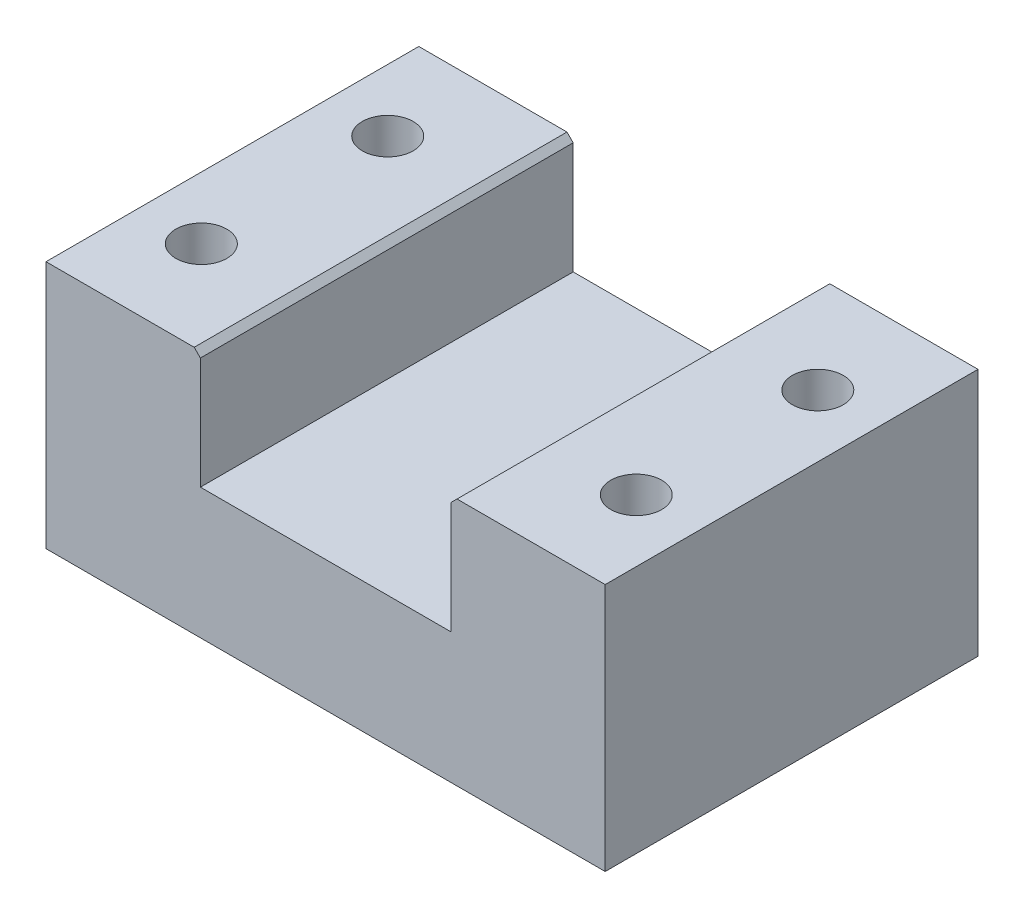
ISO-10303-21;
HEADER;
FILE_DESCRIPTION(('STEP AP214'),'2;1');
FILE_NAME('part.step','',(''),(''),'','','');
FILE_SCHEMA(('AUTOMOTIVE_DESIGN { 1 0 10303 214 1 1 1 1 }'));
ENDSEC;
DATA;
#1=APPLICATION_CONTEXT('core data for automotive mechanical design processes');
#2=APPLICATION_PROTOCOL_DEFINITION('international standard','automotive_design',2000,#1);
#3=PRODUCT_CONTEXT('',#1,'mechanical');
#4=PRODUCT('Part','Part','',(#3));
#5=PRODUCT_RELATED_PRODUCT_CATEGORY('part','',(#4));
#6=PRODUCT_DEFINITION_FORMATION('','',#4);
#7=PRODUCT_DEFINITION_CONTEXT('part definition',#1,'design');
#8=PRODUCT_DEFINITION('design','',#6,#7);
#9=PRODUCT_DEFINITION_SHAPE('','',#8);
#10=(LENGTH_UNIT() NAMED_UNIT(*) SI_UNIT(.MILLI.,.METRE.));
#11=(NAMED_UNIT(*) PLANE_ANGLE_UNIT() SI_UNIT($,.RADIAN.));
#12=(NAMED_UNIT(*) SI_UNIT($,.STERADIAN.) SOLID_ANGLE_UNIT());
#13=UNCERTAINTY_MEASURE_WITH_UNIT(LENGTH_MEASURE(1.E-05),#10,'distance_accuracy_value','');
#14=(GEOMETRIC_REPRESENTATION_CONTEXT(3) GLOBAL_UNCERTAINTY_ASSIGNED_CONTEXT((#13)) GLOBAL_UNIT_ASSIGNED_CONTEXT((#10,
#11,#12)) REPRESENTATION_CONTEXT('',''));
#15=CARTESIAN_POINT('',(0.,0.,0.));
#16=DIRECTION('',(0.,0.,1.));
#17=DIRECTION('',(1.,0.,0.));
#18=AXIS2_PLACEMENT_3D('',#15,#16,#17);
#19=CARTESIAN_POINT('',(0.,40.,0.));
#20=DIRECTION('',(0.,1.,0.));
#21=DIRECTION('',(0.,0.,1.));
#22=AXIS2_PLACEMENT_3D('',#19,#20,#21);
#23=PLANE('',#22);
#24=CARTESIAN_POINT('',(-35.,40.,-15.));
#25=DIRECTION('',(0.,-1.,0.));
#26=DIRECTION('',(0.,0.,-1.));
#27=AXIS2_PLACEMENT_3D('',#24,#25,#26);
#28=CIRCLE('',#27,4.1);
#29=CARTESIAN_POINT('',(-35.,40.,-19.1));
#30=VERTEX_POINT('',#29);
#31=EDGE_CURVE('E257',#30,#30,#28,.T.);
#32=ORIENTED_EDGE('',*,*,#31,.T.);
#33=EDGE_LOOP('',(#32));
#34=FACE_BOUND('',#33,.T.);
#35=CARTESIAN_POINT('',(-35.,40.,15.));
#36=DIRECTION('',(0.,-1.,0.));
#37=DIRECTION('',(0.,0.,-1.));
#38=AXIS2_PLACEMENT_3D('',#35,#36,#37);
#39=CIRCLE('',#38,4.1);
#40=CARTESIAN_POINT('',(-35.,40.,10.9));
#41=VERTEX_POINT('',#40);
#42=EDGE_CURVE('E141',#41,#41,#39,.T.);
#43=ORIENTED_EDGE('',*,*,#42,.T.);
#44=EDGE_LOOP('',(#43));
#45=FACE_BOUND('',#44,.T.);
#46=DIRECTION('',(1.,0.,0.));
#47=VECTOR('',#46,1.);
#48=CARTESIAN_POINT('',(45.,40.,30.));
#49=LINE('',#48,#47);
#50=CARTESIAN_POINT('',(-45.,40.,30.));
#51=VERTEX_POINT('',#50);
#52=CARTESIAN_POINT('',(-21.15,40.,30.));
#53=VERTEX_POINT('',#52);
#54=EDGE_CURVE('E152',#51,#53,#49,.T.);
#55=ORIENTED_EDGE('',*,*,#54,.T.);
#56=DIRECTION('',(0.,0.,-1.));
#57=VECTOR('',#56,1.);
#58=CARTESIAN_POINT('',(-21.15,40.,-30.));
#59=LINE('',#58,#57);
#60=CARTESIAN_POINT('',(-21.15,40.,-30.));
#61=VERTEX_POINT('',#60);
#62=EDGE_CURVE('E11',#53,#61,#59,.T.);
#63=ORIENTED_EDGE('',*,*,#62,.T.);
#64=DIRECTION('',(-1.,0.,0.));
#65=VECTOR('',#64,1.);
#66=CARTESIAN_POINT('',(45.,40.,-30.));
#67=LINE('',#66,#65);
#68=CARTESIAN_POINT('',(-45.,40.,-30.));
#69=VERTEX_POINT('',#68);
#70=EDGE_CURVE('E156',#61,#69,#67,.T.);
#71=ORIENTED_EDGE('',*,*,#70,.T.);
#72=DIRECTION('',(0.,0.,1.));
#73=VECTOR('',#72,1.);
#74=CARTESIAN_POINT('',(-45.,40.,30.));
#75=LINE('',#74,#73);
#76=EDGE_CURVE('E147',#69,#51,#75,.T.);
#77=ORIENTED_EDGE('',*,*,#76,.T.);
#78=EDGE_LOOP('',(#55,#63,#71,#77));
#79=FACE_BOUND('',#78,.T.);
#80=ADVANCED_FACE('F35',(#34,#45,#79),#23,.T.);
#81=CARTESIAN_POINT('',(-45.,40.,30.));
#82=DIRECTION('',(1.,0.,0.));
#83=DIRECTION('',(0.,0.,-1.));
#84=AXIS2_PLACEMENT_3D('',#81,#82,#83);
#85=PLANE('',#84);
#86=DIRECTION('',(0.,0.,1.));
#87=VECTOR('',#86,1.);
#88=CARTESIAN_POINT('',(-45.,0.,30.));
#89=LINE('',#88,#87);
#90=CARTESIAN_POINT('',(-45.,0.,-30.));
#91=VERTEX_POINT('',#90);
#92=CARTESIAN_POINT('',(-45.,0.,30.));
#93=VERTEX_POINT('',#92);
#94=EDGE_CURVE('E145',#91,#93,#89,.T.);
#95=ORIENTED_EDGE('',*,*,#94,.T.);
#96=DIRECTION('',(0.,-1.,0.));
#97=VECTOR('',#96,1.);
#98=CARTESIAN_POINT('',(-45.,40.,30.));
#99=LINE('',#98,#97);
#100=EDGE_CURVE('E176',#51,#93,#99,.T.);
#101=ORIENTED_EDGE('',*,*,#100,.F.);
#102=ORIENTED_EDGE('',*,*,#76,.F.);
#103=DIRECTION('',(0.,-1.,0.));
#104=VECTOR('',#103,1.);
#105=CARTESIAN_POINT('',(-45.,40.,-30.));
#106=LINE('',#105,#104);
#107=EDGE_CURVE('E160',#69,#91,#106,.T.);
#108=ORIENTED_EDGE('',*,*,#107,.T.);
#109=EDGE_LOOP('',(#95,#101,#102,#108));
#110=FACE_BOUND('',#109,.T.);
#111=ADVANCED_FACE('F215',(#110),#85,.F.);
#112=CARTESIAN_POINT('',(45.,40.,30.));
#113=DIRECTION('',(0.,0.,-1.));
#114=DIRECTION('',(-1.,0.,0.));
#115=AXIS2_PLACEMENT_3D('',#112,#113,#114);
#116=PLANE('',#115);
#117=CARTESIAN_POINT('',(21.15,40.,30.));
#118=VERTEX_POINT('',#117);
#119=CARTESIAN_POINT('',(45.,40.,30.));
#120=VERTEX_POINT('',#119);
#121=EDGE_CURVE('E150',#118,#120,#49,.T.);
#122=ORIENTED_EDGE('',*,*,#121,.F.);
#123=DIRECTION('',(-0.707106781186548,-0.707106781186548,0.));
#124=VECTOR('',#123,1.);
#125=CARTESIAN_POINT('',(20.15,39.,30.));
#126=LINE('',#125,#124);
#127=CARTESIAN_POINT('',(20.15,39.,30.));
#128=VERTEX_POINT('',#127);
#129=EDGE_CURVE('E188',#118,#128,#126,.T.);
#130=ORIENTED_EDGE('',*,*,#129,.T.);
#131=DIRECTION('',(0.,1.,0.));
#132=VECTOR('',#131,1.);
#133=CARTESIAN_POINT('',(20.15,59.,30.));
#134=LINE('',#133,#132);
#135=CARTESIAN_POINT('',(20.15,21.,30.));
#136=VERTEX_POINT('',#135);
#137=EDGE_CURVE('E121',#136,#128,#134,.T.);
#138=ORIENTED_EDGE('',*,*,#137,.F.);
#139=DIRECTION('',(1.,0.,0.));
#140=VECTOR('',#139,1.);
#141=CARTESIAN_POINT('',(20.15,21.,30.));
#142=LINE('',#141,#140);
#143=CARTESIAN_POINT('',(-20.15,21.,30.));
#144=VERTEX_POINT('',#143);
#145=EDGE_CURVE('E140',#144,#136,#142,.T.);
#146=ORIENTED_EDGE('',*,*,#145,.F.);
#147=DIRECTION('',(0.,-1.,0.));
#148=VECTOR('',#147,1.);
#149=CARTESIAN_POINT('',(-20.15,59.,30.));
#150=LINE('',#149,#148);
#151=CARTESIAN_POINT('',(-20.15,39.,30.));
#152=VERTEX_POINT('',#151);
#153=EDGE_CURVE('E126',#152,#144,#150,.T.);
#154=ORIENTED_EDGE('',*,*,#153,.F.);
#155=DIRECTION('',(-0.707106781186552,0.707106781186543,0.));
#156=VECTOR('',#155,1.);
#157=CARTESIAN_POINT('',(-20.15,39.,30.));
#158=LINE('',#157,#156);
#159=EDGE_CURVE('E50',#152,#53,#158,.T.);
#160=ORIENTED_EDGE('',*,*,#159,.T.);
#161=ORIENTED_EDGE('',*,*,#54,.F.);
#162=ORIENTED_EDGE('',*,*,#100,.T.);
#163=DIRECTION('',(1.,0.,0.));
#164=VECTOR('',#163,1.);
#165=CARTESIAN_POINT('',(45.,0.,30.));
#166=LINE('',#165,#164);
#167=CARTESIAN_POINT('',(45.,0.,30.));
#168=VERTEX_POINT('',#167);
#169=EDGE_CURVE('E163',#93,#168,#166,.T.);
#170=ORIENTED_EDGE('',*,*,#169,.T.);
#171=DIRECTION('',(0.,-1.,0.));
#172=VECTOR('',#171,1.);
#173=CARTESIAN_POINT('',(45.,40.,30.));
#174=LINE('',#173,#172);
#175=EDGE_CURVE('E173',#120,#168,#174,.T.);
#176=ORIENTED_EDGE('',*,*,#175,.F.);
#177=EDGE_LOOP('',(#122,#130,#138,#146,#154,#160,#161,#162,#170,#176));
#178=FACE_BOUND('',#177,.T.);
#179=ADVANCED_FACE('F190',(#178),#116,.F.);
#180=CARTESIAN_POINT('',(45.,40.,30.));
#181=DIRECTION('',(-1.,0.,0.));
#182=DIRECTION('',(0.,0.,1.));
#183=AXIS2_PLACEMENT_3D('',#180,#181,#182);
#184=PLANE('',#183);
#185=DIRECTION('',(0.,0.,-1.));
#186=VECTOR('',#185,1.);
#187=CARTESIAN_POINT('',(45.,0.,30.));
#188=LINE('',#187,#186);
#189=CARTESIAN_POINT('',(45.,0.,-30.));
#190=VERTEX_POINT('',#189);
#191=EDGE_CURVE('E165',#168,#190,#188,.T.);
#192=ORIENTED_EDGE('',*,*,#191,.T.);
#193=DIRECTION('',(0.,-1.,0.));
#194=VECTOR('',#193,1.);
#195=CARTESIAN_POINT('',(45.,40.,-30.));
#196=LINE('',#195,#194);
#197=CARTESIAN_POINT('',(45.,40.,-30.));
#198=VERTEX_POINT('',#197);
#199=EDGE_CURVE('E170',#198,#190,#196,.T.);
#200=ORIENTED_EDGE('',*,*,#199,.F.);
#201=DIRECTION('',(0.,0.,-1.));
#202=VECTOR('',#201,1.);
#203=CARTESIAN_POINT('',(45.,40.,30.));
#204=LINE('',#203,#202);
#205=EDGE_CURVE('E154',#120,#198,#204,.T.);
#206=ORIENTED_EDGE('',*,*,#205,.F.);
#207=ORIENTED_EDGE('',*,*,#175,.T.);
#208=EDGE_LOOP('',(#192,#200,#206,#207));
#209=FACE_BOUND('',#208,.T.);
#210=ADVANCED_FACE('F206',(#209),#184,.F.);
#211=CARTESIAN_POINT('',(45.,40.,-30.));
#212=DIRECTION('',(0.,0.,1.));
#213=DIRECTION('',(1.,0.,0.));
#214=AXIS2_PLACEMENT_3D('',#211,#212,#213);
#215=PLANE('',#214);
#216=DIRECTION('',(0.,1.,0.));
#217=VECTOR('',#216,1.);
#218=CARTESIAN_POINT('',(20.15,59.,-30.));
#219=LINE('',#218,#217);
#220=CARTESIAN_POINT('',(20.15,21.,-30.));
#221=VERTEX_POINT('',#220);
#222=CARTESIAN_POINT('',(20.15,39.,-30.));
#223=VERTEX_POINT('',#222);
#224=EDGE_CURVE('E131',#221,#223,#219,.T.);
#225=ORIENTED_EDGE('',*,*,#224,.T.);
#226=DIRECTION('',(0.707106781186548,0.707106781186548,0.));
#227=VECTOR('',#226,1.);
#228=CARTESIAN_POINT('',(20.15,39.,-30.));
#229=LINE('',#228,#227);
#230=CARTESIAN_POINT('',(21.15,40.,-30.));
#231=VERTEX_POINT('',#230);
#232=EDGE_CURVE('E183',#223,#231,#229,.T.);
#233=ORIENTED_EDGE('',*,*,#232,.T.);
#234=EDGE_CURVE('E157',#198,#231,#67,.T.);
#235=ORIENTED_EDGE('',*,*,#234,.F.);
#236=ORIENTED_EDGE('',*,*,#199,.T.);
#237=DIRECTION('',(-1.,0.,0.));
#238=VECTOR('',#237,1.);
#239=CARTESIAN_POINT('',(45.,0.,-30.));
#240=LINE('',#239,#238);
#241=EDGE_CURVE('E151',#190,#91,#240,.T.);
#242=ORIENTED_EDGE('',*,*,#241,.T.);
#243=ORIENTED_EDGE('',*,*,#107,.F.);
#244=ORIENTED_EDGE('',*,*,#70,.F.);
#245=DIRECTION('',(0.707106781186552,-0.707106781186543,0.));
#246=VECTOR('',#245,1.);
#247=CARTESIAN_POINT('',(-20.15,39.,-30.));
#248=LINE('',#247,#246);
#249=CARTESIAN_POINT('',(-20.15,39.,-30.));
#250=VERTEX_POINT('',#249);
#251=EDGE_CURVE('E119',#61,#250,#248,.T.);
#252=ORIENTED_EDGE('',*,*,#251,.T.);
#253=DIRECTION('',(0.,-1.,0.));
#254=VECTOR('',#253,1.);
#255=CARTESIAN_POINT('',(-20.15,59.,-30.));
#256=LINE('',#255,#254);
#257=CARTESIAN_POINT('',(-20.15,21.,-30.));
#258=VERTEX_POINT('',#257);
#259=EDGE_CURVE('E111',#250,#258,#256,.T.);
#260=ORIENTED_EDGE('',*,*,#259,.T.);
#261=DIRECTION('',(1.,0.,0.));
#262=VECTOR('',#261,1.);
#263=CARTESIAN_POINT('',(20.15,21.,-30.));
#264=LINE('',#263,#262);
#265=EDGE_CURVE('E116',#258,#221,#264,.T.);
#266=ORIENTED_EDGE('',*,*,#265,.T.);
#267=EDGE_LOOP('',(#225,#233,#235,#236,#242,#243,#244,#252,#260,#266));
#268=FACE_BOUND('',#267,.T.);
#269=ADVANCED_FACE('F114',(#268),#215,.F.);
#270=CARTESIAN_POINT('',(35.,40.,-14.2172732356869));
#271=DIRECTION('',(0.,-1.,0.));
#272=DIRECTION('',(0.,0.,-1.));
#273=AXIS2_PLACEMENT_3D('',#270,#271,#272);
#274=CIRCLE('',#273,4.1);
#275=CARTESIAN_POINT('',(35.,40.,-18.3172732356869));
#276=VERTEX_POINT('',#275);
#277=EDGE_CURVE('E240',#276,#276,#274,.T.);
#278=ORIENTED_EDGE('',*,*,#277,.T.);
#279=EDGE_LOOP('',(#278));
#280=FACE_BOUND('',#279,.T.);
#281=CARTESIAN_POINT('',(35.,40.,15.));
#282=DIRECTION('',(0.,-1.,0.));
#283=DIRECTION('',(0.,0.,-1.));
#284=AXIS2_PLACEMENT_3D('',#281,#282,#283);
#285=CIRCLE('',#284,4.1);
#286=CARTESIAN_POINT('',(35.,40.,10.9));
#287=VERTEX_POINT('',#286);
#288=EDGE_CURVE('E243',#287,#287,#285,.T.);
#289=ORIENTED_EDGE('',*,*,#288,.T.);
#290=EDGE_LOOP('',(#289));
#291=FACE_BOUND('',#290,.T.);
#292=ORIENTED_EDGE('',*,*,#234,.T.);
#293=DIRECTION('',(0.,0.,1.));
#294=VECTOR('',#293,1.);
#295=CARTESIAN_POINT('',(21.15,40.,30.));
#296=LINE('',#295,#294);
#297=EDGE_CURVE('E185',#231,#118,#296,.T.);
#298=ORIENTED_EDGE('',*,*,#297,.T.);
#299=ORIENTED_EDGE('',*,*,#121,.T.);
#300=ORIENTED_EDGE('',*,*,#205,.T.);
#301=EDGE_LOOP('',(#292,#298,#299,#300));
#302=FACE_BOUND('',#301,.T.);
#303=ADVANCED_FACE('F201',(#280,#291,#302),#23,.T.);
#304=CARTESIAN_POINT('',(0.,0.,0.));
#305=DIRECTION('',(0.,1.,0.));
#306=DIRECTION('',(0.,0.,1.));
#307=AXIS2_PLACEMENT_3D('',#304,#305,#306);
#308=PLANE('',#307);
#309=CARTESIAN_POINT('',(-35.,0.,-15.));
#310=DIRECTION('',(0.,-1.,0.));
#311=DIRECTION('',(0.,0.,-1.));
#312=AXIS2_PLACEMENT_3D('',#309,#310,#311);
#313=CIRCLE('',#312,4.1);
#314=CARTESIAN_POINT('',(-35.,0.,-19.1));
#315=VERTEX_POINT('',#314);
#316=EDGE_CURVE('E260',#315,#315,#313,.T.);
#317=ORIENTED_EDGE('',*,*,#316,.F.);
#318=EDGE_LOOP('',(#317));
#319=FACE_BOUND('',#318,.T.);
#320=CARTESIAN_POINT('',(35.,0.,-14.2172732356869));
#321=DIRECTION('',(0.,-1.,0.));
#322=DIRECTION('',(0.,0.,-1.));
#323=AXIS2_PLACEMENT_3D('',#320,#321,#322);
#324=CIRCLE('',#323,4.1);
#325=CARTESIAN_POINT('',(35.,0.,-18.3172732356869));
#326=VERTEX_POINT('',#325);
#327=EDGE_CURVE('E245',#326,#326,#324,.T.);
#328=ORIENTED_EDGE('',*,*,#327,.F.);
#329=EDGE_LOOP('',(#328));
#330=FACE_BOUND('',#329,.T.);
#331=CARTESIAN_POINT('',(35.,0.,15.));
#332=DIRECTION('',(0.,-1.,0.));
#333=DIRECTION('',(0.,0.,-1.));
#334=AXIS2_PLACEMENT_3D('',#331,#332,#333);
#335=CIRCLE('',#334,4.1);
#336=CARTESIAN_POINT('',(35.,0.,10.9));
#337=VERTEX_POINT('',#336);
#338=EDGE_CURVE('E246',#337,#337,#335,.T.);
#339=ORIENTED_EDGE('',*,*,#338,.F.);
#340=EDGE_LOOP('',(#339));
#341=FACE_BOUND('',#340,.T.);
#342=CARTESIAN_POINT('',(-35.,0.,15.));
#343=DIRECTION('',(0.,-1.,0.));
#344=DIRECTION('',(0.,0.,-1.));
#345=AXIS2_PLACEMENT_3D('',#342,#343,#344);
#346=CIRCLE('',#345,4.1);
#347=CARTESIAN_POINT('',(-35.,0.,10.9));
#348=VERTEX_POINT('',#347);
#349=EDGE_CURVE('E255',#348,#348,#346,.T.);
#350=ORIENTED_EDGE('',*,*,#349,.F.);
#351=EDGE_LOOP('',(#350));
#352=FACE_BOUND('',#351,.T.);
#353=ORIENTED_EDGE('',*,*,#94,.F.);
#354=ORIENTED_EDGE('',*,*,#241,.F.);
#355=ORIENTED_EDGE('',*,*,#191,.F.);
#356=ORIENTED_EDGE('',*,*,#169,.F.);
#357=EDGE_LOOP('',(#353,#354,#355,#356));
#358=FACE_BOUND('',#357,.T.);
#359=ADVANCED_FACE('F212',(#319,#330,#341,#352,#358),#308,.F.);
#360=CARTESIAN_POINT('',(-20.15,59.,-30.));
#361=DIRECTION('',(-1.,0.,0.));
#362=DIRECTION('',(0.,-1.,0.));
#363=AXIS2_PLACEMENT_3D('',#360,#361,#362);
#364=PLANE('',#363);
#365=ORIENTED_EDGE('',*,*,#259,.F.);
#366=DIRECTION('',(0.,0.,1.));
#367=VECTOR('',#366,1.);
#368=CARTESIAN_POINT('',(-20.15,39.,30.));
#369=LINE('',#368,#367);
#370=EDGE_CURVE('E43',#250,#152,#369,.T.);
#371=ORIENTED_EDGE('',*,*,#370,.T.);
#372=ORIENTED_EDGE('',*,*,#153,.T.);
#373=DIRECTION('',(0.,0.,1.));
#374=VECTOR('',#373,1.);
#375=CARTESIAN_POINT('',(-20.15,21.,-30.));
#376=LINE('',#375,#374);
#377=EDGE_CURVE('E124',#258,#144,#376,.T.);
#378=ORIENTED_EDGE('',*,*,#377,.F.);
#379=EDGE_LOOP('',(#365,#371,#372,#378));
#380=FACE_BOUND('',#379,.T.);
#381=ADVANCED_FACE('F125',(#380),#364,.F.);
#382=CARTESIAN_POINT('',(20.15,59.,-30.));
#383=DIRECTION('',(1.,0.,0.));
#384=DIRECTION('',(0.,1.,0.));
#385=AXIS2_PLACEMENT_3D('',#382,#383,#384);
#386=PLANE('',#385);
#387=ORIENTED_EDGE('',*,*,#137,.T.);
#388=DIRECTION('',(0.,0.,-1.));
#389=VECTOR('',#388,1.);
#390=CARTESIAN_POINT('',(20.15,39.,-30.));
#391=LINE('',#390,#389);
#392=EDGE_CURVE('E179',#128,#223,#391,.T.);
#393=ORIENTED_EDGE('',*,*,#392,.T.);
#394=ORIENTED_EDGE('',*,*,#224,.F.);
#395=DIRECTION('',(0.,0.,1.));
#396=VECTOR('',#395,1.);
#397=CARTESIAN_POINT('',(20.15,21.,-30.));
#398=LINE('',#397,#396);
#399=EDGE_CURVE('E130',#221,#136,#398,.T.);
#400=ORIENTED_EDGE('',*,*,#399,.T.);
#401=EDGE_LOOP('',(#387,#393,#394,#400));
#402=FACE_BOUND('',#401,.T.);
#403=ADVANCED_FACE('F195',(#402),#386,.F.);
#404=CARTESIAN_POINT('',(20.15,21.,-30.));
#405=DIRECTION('',(0.,-1.,0.));
#406=DIRECTION('',(1.,0.,0.));
#407=AXIS2_PLACEMENT_3D('',#404,#405,#406);
#408=PLANE('',#407);
#409=ORIENTED_EDGE('',*,*,#145,.T.);
#410=ORIENTED_EDGE('',*,*,#399,.F.);
#411=ORIENTED_EDGE('',*,*,#265,.F.);
#412=ORIENTED_EDGE('',*,*,#377,.T.);
#413=EDGE_LOOP('',(#409,#410,#411,#412));
#414=FACE_BOUND('',#413,.T.);
#415=ADVANCED_FACE('F133',(#414),#408,.F.);
#416=CARTESIAN_POINT('',(-35.,40.,15.));
#417=DIRECTION('',(0.,-1.,0.));
#418=DIRECTION('',(0.,0.,-1.));
#419=AXIS2_PLACEMENT_3D('',#416,#417,#418);
#420=CYLINDRICAL_SURFACE('',#419,4.1);
#421=ORIENTED_EDGE('',*,*,#42,.F.);
#422=EDGE_LOOP('',(#421));
#423=FACE_BOUND('',#422,.T.);
#424=ORIENTED_EDGE('',*,*,#349,.T.);
#425=EDGE_LOOP('',(#424));
#426=FACE_BOUND('',#425,.T.);
#427=ADVANCED_FACE('F277',(#423,#426),#420,.F.);
#428=CARTESIAN_POINT('',(35.,40.,15.));
#429=DIRECTION('',(0.,-1.,0.));
#430=DIRECTION('',(0.,0.,-1.));
#431=AXIS2_PLACEMENT_3D('',#428,#429,#430);
#432=CYLINDRICAL_SURFACE('',#431,4.1);
#433=ORIENTED_EDGE('',*,*,#288,.F.);
#434=EDGE_LOOP('',(#433));
#435=FACE_BOUND('',#434,.T.);
#436=ORIENTED_EDGE('',*,*,#338,.T.);
#437=EDGE_LOOP('',(#436));
#438=FACE_BOUND('',#437,.T.);
#439=ADVANCED_FACE('F274',(#435,#438),#432,.F.);
#440=CARTESIAN_POINT('',(35.,40.,-14.2172732356869));
#441=DIRECTION('',(0.,-1.,0.));
#442=DIRECTION('',(0.,0.,-1.));
#443=AXIS2_PLACEMENT_3D('',#440,#441,#442);
#444=CYLINDRICAL_SURFACE('',#443,4.1);
#445=ORIENTED_EDGE('',*,*,#277,.F.);
#446=EDGE_LOOP('',(#445));
#447=FACE_BOUND('',#446,.T.);
#448=ORIENTED_EDGE('',*,*,#327,.T.);
#449=EDGE_LOOP('',(#448));
#450=FACE_BOUND('',#449,.T.);
#451=ADVANCED_FACE('F276',(#447,#450),#444,.F.);
#452=CARTESIAN_POINT('',(-35.,40.,-15.));
#453=DIRECTION('',(0.,-1.,0.));
#454=DIRECTION('',(0.,0.,-1.));
#455=AXIS2_PLACEMENT_3D('',#452,#453,#454);
#456=CYLINDRICAL_SURFACE('',#455,4.1);
#457=ORIENTED_EDGE('',*,*,#31,.F.);
#458=EDGE_LOOP('',(#457));
#459=FACE_BOUND('',#458,.T.);
#460=ORIENTED_EDGE('',*,*,#316,.T.);
#461=EDGE_LOOP('',(#460));
#462=FACE_BOUND('',#461,.T.);
#463=ADVANCED_FACE('F267',(#459,#462),#456,.F.);
#464=CARTESIAN_POINT('',(20.15,39.,-30.));
#465=DIRECTION('',(-0.707106781186547,0.707106781186547,0.));
#466=DIRECTION('',(0.,0.,1.));
#467=AXIS2_PLACEMENT_3D('',#464,#465,#466);
#468=PLANE('',#467);
#469=ORIENTED_EDGE('',*,*,#129,.F.);
#470=ORIENTED_EDGE('',*,*,#297,.F.);
#471=ORIENTED_EDGE('',*,*,#232,.F.);
#472=ORIENTED_EDGE('',*,*,#392,.F.);
#473=EDGE_LOOP('',(#469,#470,#471,#472));
#474=FACE_BOUND('',#473,.T.);
#475=ADVANCED_FACE('F197',(#474),#468,.T.);
#476=CARTESIAN_POINT('',(-20.15,39.,-30.));
#477=DIRECTION('',(0.707106781186543,0.707106781186552,0.));
#478=DIRECTION('',(0.,0.,-1.));
#479=AXIS2_PLACEMENT_3D('',#476,#477,#478);
#480=PLANE('',#479);
#481=ORIENTED_EDGE('',*,*,#251,.F.);
#482=ORIENTED_EDGE('',*,*,#62,.F.);
#483=ORIENTED_EDGE('',*,*,#159,.F.);
#484=ORIENTED_EDGE('',*,*,#370,.F.);
#485=EDGE_LOOP('',(#481,#482,#483,#484));
#486=FACE_BOUND('',#485,.T.);
#487=ADVANCED_FACE('F37',(#486),#480,.T.);
#488=CLOSED_SHELL('',(#80,#111,#179,#210,#269,#303,#359,#381,#403,#415,#427,#439,#451,#463,#475,#487));
#489=MANIFOLD_SOLID_BREP('B2',#488);
#490=ADVANCED_BREP_SHAPE_REPRESENTATION('',(#18,#489),#14);
#491=SHAPE_DEFINITION_REPRESENTATION(#9,#490);
ENDSEC;
END-ISO-10303-21;
